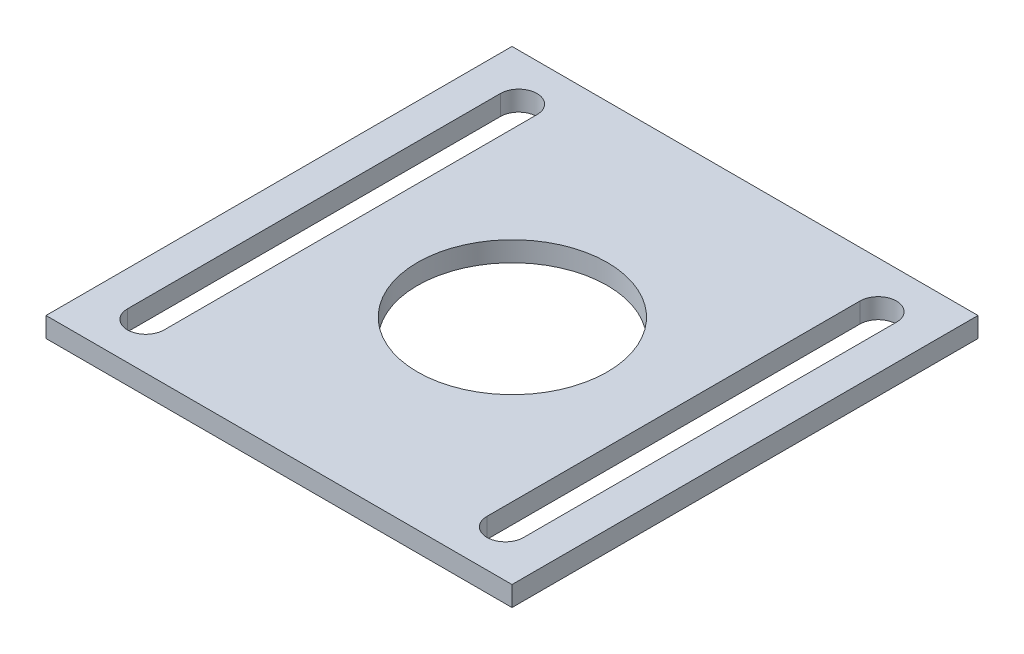
ISO-10303-21;
HEADER;
FILE_DESCRIPTION(('STEP AP214'),'2;1');
FILE_NAME('part.step','',(''),(''),'','','');
FILE_SCHEMA(('AUTOMOTIVE_DESIGN { 1 0 10303 214 1 1 1 1 }'));
ENDSEC;
DATA;
#1=APPLICATION_CONTEXT('core data for automotive mechanical design processes');
#2=APPLICATION_PROTOCOL_DEFINITION('international standard','automotive_design',2000,#1);
#3=PRODUCT_CONTEXT('',#1,'mechanical');
#4=PRODUCT('Part','Part','',(#3));
#5=PRODUCT_RELATED_PRODUCT_CATEGORY('part','',(#4));
#6=PRODUCT_DEFINITION_FORMATION('','',#4);
#7=PRODUCT_DEFINITION_CONTEXT('part definition',#1,'design');
#8=PRODUCT_DEFINITION('design','',#6,#7);
#9=PRODUCT_DEFINITION_SHAPE('','',#8);
#10=(LENGTH_UNIT() NAMED_UNIT(*) SI_UNIT(.MILLI.,.METRE.));
#11=(NAMED_UNIT(*) PLANE_ANGLE_UNIT() SI_UNIT($,.RADIAN.));
#12=(NAMED_UNIT(*) SI_UNIT($,.STERADIAN.) SOLID_ANGLE_UNIT());
#13=UNCERTAINTY_MEASURE_WITH_UNIT(LENGTH_MEASURE(1.E-05),#10,'distance_accuracy_value','');
#14=(GEOMETRIC_REPRESENTATION_CONTEXT(3) GLOBAL_UNCERTAINTY_ASSIGNED_CONTEXT((#13)) GLOBAL_UNIT_ASSIGNED_CONTEXT((#10,
#11,#12)) REPRESENTATION_CONTEXT('',''));
#15=CARTESIAN_POINT('',(0.,0.,0.));
#16=DIRECTION('',(0.,0.,1.));
#17=DIRECTION('',(1.,0.,0.));
#18=AXIS2_PLACEMENT_3D('',#15,#16,#17);
#19=CARTESIAN_POINT('',(0.,3.,0.));
#20=DIRECTION('',(-1.,0.,0.));
#21=DIRECTION('',(0.,0.,1.));
#22=AXIS2_PLACEMENT_3D('',#19,#20,#21);
#23=PLANE('',#22);
#24=DIRECTION('',(0.,0.,-1.));
#25=VECTOR('',#24,1.);
#26=CARTESIAN_POINT('',(0.,0.,0.));
#27=LINE('',#26,#25);
#28=CARTESIAN_POINT('',(0.,0.,0.));
#29=VERTEX_POINT('',#28);
#30=CARTESIAN_POINT('',(0.,0.,-70.));
#31=VERTEX_POINT('',#30);
#32=EDGE_CURVE('E260',#29,#31,#27,.T.);
#33=ORIENTED_EDGE('',*,*,#32,.F.);
#34=DIRECTION('',(0.,-1.,0.));
#35=VECTOR('',#34,1.);
#36=CARTESIAN_POINT('',(0.,3.,0.));
#37=LINE('',#36,#35);
#38=CARTESIAN_POINT('',(0.,3.,0.));
#39=VERTEX_POINT('',#38);
#40=EDGE_CURVE('E12',#39,#29,#37,.T.);
#41=ORIENTED_EDGE('',*,*,#40,.F.);
#42=DIRECTION('',(0.,0.,-1.));
#43=VECTOR('',#42,1.);
#44=CARTESIAN_POINT('',(0.,3.,0.));
#45=LINE('',#44,#43);
#46=CARTESIAN_POINT('',(0.,3.,-70.));
#47=VERTEX_POINT('',#46);
#48=EDGE_CURVE('E257',#39,#47,#45,.T.);
#49=ORIENTED_EDGE('',*,*,#48,.T.);
#50=DIRECTION('',(0.,-1.,0.));
#51=VECTOR('',#50,1.);
#52=CARTESIAN_POINT('',(0.,3.,-70.));
#53=LINE('',#52,#51);
#54=EDGE_CURVE('E51',#47,#31,#53,.T.);
#55=ORIENTED_EDGE('',*,*,#54,.T.);
#56=EDGE_LOOP('',(#33,#41,#49,#55));
#57=FACE_BOUND('',#56,.T.);
#58=ADVANCED_FACE('F48',(#57),#23,.T.);
#59=CARTESIAN_POINT('',(0.,3.,0.));
#60=DIRECTION('',(0.,0.,-1.));
#61=DIRECTION('',(-1.,0.,0.));
#62=AXIS2_PLACEMENT_3D('',#59,#60,#61);
#63=PLANE('',#62);
#64=DIRECTION('',(1.,0.,0.));
#65=VECTOR('',#64,1.);
#66=CARTESIAN_POINT('',(0.,0.,0.));
#67=LINE('',#66,#65);
#68=CARTESIAN_POINT('',(70.,0.,0.));
#69=VERTEX_POINT('',#68);
#70=EDGE_CURVE('E285',#29,#69,#67,.T.);
#71=ORIENTED_EDGE('',*,*,#70,.T.);
#72=DIRECTION('',(0.,-1.,0.));
#73=VECTOR('',#72,1.);
#74=CARTESIAN_POINT('',(70.,3.,0.));
#75=LINE('',#74,#73);
#76=CARTESIAN_POINT('',(70.,3.,0.));
#77=VERTEX_POINT('',#76);
#78=EDGE_CURVE('E60',#77,#69,#75,.T.);
#79=ORIENTED_EDGE('',*,*,#78,.F.);
#80=DIRECTION('',(1.,0.,0.));
#81=VECTOR('',#80,1.);
#82=CARTESIAN_POINT('',(0.,3.,0.));
#83=LINE('',#82,#81);
#84=EDGE_CURVE('E266',#39,#77,#83,.T.);
#85=ORIENTED_EDGE('',*,*,#84,.F.);
#86=ORIENTED_EDGE('',*,*,#40,.T.);
#87=EDGE_LOOP('',(#71,#79,#85,#86));
#88=FACE_BOUND('',#87,.T.);
#89=ADVANCED_FACE('F307',(#88),#63,.F.);
#90=CARTESIAN_POINT('',(70.,3.,0.));
#91=DIRECTION('',(-1.,0.,0.));
#92=DIRECTION('',(0.,0.,1.));
#93=AXIS2_PLACEMENT_3D('',#90,#91,#92);
#94=PLANE('',#93);
#95=DIRECTION('',(0.,0.,-1.));
#96=VECTOR('',#95,1.);
#97=CARTESIAN_POINT('',(70.,0.,0.));
#98=LINE('',#97,#96);
#99=CARTESIAN_POINT('',(70.,0.,-70.));
#100=VERTEX_POINT('',#99);
#101=EDGE_CURVE('E276',#69,#100,#98,.T.);
#102=ORIENTED_EDGE('',*,*,#101,.T.);
#103=DIRECTION('',(0.,-1.,0.));
#104=VECTOR('',#103,1.);
#105=CARTESIAN_POINT('',(70.,3.,-70.));
#106=LINE('',#105,#104);
#107=CARTESIAN_POINT('',(70.,3.,-70.));
#108=VERTEX_POINT('',#107);
#109=EDGE_CURVE('E288',#108,#100,#106,.T.);
#110=ORIENTED_EDGE('',*,*,#109,.F.);
#111=DIRECTION('',(0.,0.,-1.));
#112=VECTOR('',#111,1.);
#113=CARTESIAN_POINT('',(70.,3.,0.));
#114=LINE('',#113,#112);
#115=EDGE_CURVE('E269',#77,#108,#114,.T.);
#116=ORIENTED_EDGE('',*,*,#115,.F.);
#117=ORIENTED_EDGE('',*,*,#78,.T.);
#118=EDGE_LOOP('',(#102,#110,#116,#117));
#119=FACE_BOUND('',#118,.T.);
#120=ADVANCED_FACE('F313',(#119),#94,.F.);
#121=CARTESIAN_POINT('',(0.,3.,-70.));
#122=DIRECTION('',(0.,0.,-1.));
#123=DIRECTION('',(-1.,0.,0.));
#124=AXIS2_PLACEMENT_3D('',#121,#122,#123);
#125=PLANE('',#124);
#126=DIRECTION('',(1.,0.,0.));
#127=VECTOR('',#126,1.);
#128=CARTESIAN_POINT('',(0.,0.,-70.));
#129=LINE('',#128,#127);
#130=EDGE_CURVE('E274',#31,#100,#129,.T.);
#131=ORIENTED_EDGE('',*,*,#130,.F.);
#132=ORIENTED_EDGE('',*,*,#54,.F.);
#133=DIRECTION('',(1.,0.,0.));
#134=VECTOR('',#133,1.);
#135=CARTESIAN_POINT('',(0.,3.,-70.));
#136=LINE('',#135,#134);
#137=EDGE_CURVE('E314',#47,#108,#136,.T.);
#138=ORIENTED_EDGE('',*,*,#137,.T.);
#139=ORIENTED_EDGE('',*,*,#109,.T.);
#140=EDGE_LOOP('',(#131,#132,#138,#139));
#141=FACE_BOUND('',#140,.T.);
#142=ADVANCED_FACE('F297',(#141),#125,.T.);
#143=CARTESIAN_POINT('',(0.,3.,0.));
#144=DIRECTION('',(0.,-1.,0.));
#145=DIRECTION('',(0.,0.,-1.));
#146=AXIS2_PLACEMENT_3D('',#143,#144,#145);
#147=PLANE('',#146);
#148=DIRECTION('',(0.,0.,1.));
#149=VECTOR('',#148,1.);
#150=CARTESIAN_POINT('',(59.25,3.,-63.0084103239682));
#151=LINE('',#150,#149);
#152=CARTESIAN_POINT('',(59.25,3.,-63.0084103239682));
#153=VERTEX_POINT('',#152);
#154=CARTESIAN_POINT('',(59.25,3.,-6.99158967603184));
#155=VERTEX_POINT('',#154);
#156=EDGE_CURVE('E206',#153,#155,#151,.T.);
#157=ORIENTED_EDGE('',*,*,#156,.F.);
#158=CARTESIAN_POINT('',(62.,3.,-63.0084103239682));
#159=DIRECTION('',(0.,1.,0.));
#160=DIRECTION('',(0.,0.,1.));
#161=AXIS2_PLACEMENT_3D('',#158,#159,#160);
#162=CIRCLE('',#161,2.75);
#163=CARTESIAN_POINT('',(64.75,3.,-63.0084103239682));
#164=VERTEX_POINT('',#163);
#165=EDGE_CURVE('E62',#164,#153,#162,.T.);
#166=ORIENTED_EDGE('',*,*,#165,.F.);
#167=DIRECTION('',(0.,0.,-1.));
#168=VECTOR('',#167,1.);
#169=CARTESIAN_POINT('',(64.75,3.,-63.0084103239682));
#170=LINE('',#169,#168);
#171=CARTESIAN_POINT('',(64.75,3.,-6.99158967603183));
#172=VERTEX_POINT('',#171);
#173=EDGE_CURVE('E212',#172,#164,#170,.T.);
#174=ORIENTED_EDGE('',*,*,#173,.F.);
#175=CARTESIAN_POINT('',(62.,3.,-6.99158967603183));
#176=DIRECTION('',(0.,1.,0.));
#177=DIRECTION('',(0.,0.,1.));
#178=AXIS2_PLACEMENT_3D('',#175,#176,#177);
#179=CIRCLE('',#178,2.75);
#180=EDGE_CURVE('E209',#155,#172,#179,.T.);
#181=ORIENTED_EDGE('',*,*,#180,.F.);
#182=EDGE_LOOP('',(#157,#166,#174,#181));
#183=FACE_BOUND('',#182,.T.);
#184=DIRECTION('',(0.,0.,1.));
#185=VECTOR('',#184,1.);
#186=CARTESIAN_POINT('',(5.25,3.,-63.0084103239682));
#187=LINE('',#186,#185);
#188=CARTESIAN_POINT('',(5.25,3.,-63.0084103239682));
#189=VERTEX_POINT('',#188);
#190=CARTESIAN_POINT('',(5.25,3.,-6.99158967603184));
#191=VERTEX_POINT('',#190);
#192=EDGE_CURVE('E159',#189,#191,#187,.T.);
#193=ORIENTED_EDGE('',*,*,#192,.F.);
#194=CARTESIAN_POINT('',(8.,3.,-63.0084103239682));
#195=DIRECTION('',(0.,1.,0.));
#196=DIRECTION('',(0.,0.,1.));
#197=AXIS2_PLACEMENT_3D('',#194,#195,#196);
#198=CIRCLE('',#197,2.75);
#199=CARTESIAN_POINT('',(10.75,3.,-63.0084103239682));
#200=VERTEX_POINT('',#199);
#201=EDGE_CURVE('E71',#200,#189,#198,.T.);
#202=ORIENTED_EDGE('',*,*,#201,.F.);
#203=DIRECTION('',(0.,0.,-1.));
#204=VECTOR('',#203,1.);
#205=CARTESIAN_POINT('',(10.75,3.,-63.0084103239682));
#206=LINE('',#205,#204);
#207=CARTESIAN_POINT('',(10.75,3.,-6.99158967603183));
#208=VERTEX_POINT('',#207);
#209=EDGE_CURVE('E146',#208,#200,#206,.T.);
#210=ORIENTED_EDGE('',*,*,#209,.F.);
#211=CARTESIAN_POINT('',(8.,3.,-6.99158967603183));
#212=DIRECTION('',(0.,1.,0.));
#213=DIRECTION('',(0.,0.,1.));
#214=AXIS2_PLACEMENT_3D('',#211,#212,#213);
#215=CIRCLE('',#214,2.75);
#216=EDGE_CURVE('E152',#191,#208,#215,.T.);
#217=ORIENTED_EDGE('',*,*,#216,.F.);
#218=EDGE_LOOP('',(#193,#202,#210,#217));
#219=FACE_BOUND('',#218,.T.);
#220=CARTESIAN_POINT('',(35.2514133048523,3.,-34.8026013268432));
#221=DIRECTION('',(0.,1.,0.));
#222=DIRECTION('',(0.,0.,1.));
#223=AXIS2_PLACEMENT_3D('',#220,#221,#222);
#224=CIRCLE('',#223,14.255);
#225=CARTESIAN_POINT('',(35.2514133048523,3.,-20.5476013268432));
#226=VERTEX_POINT('',#225);
#227=EDGE_CURVE('E165',#226,#226,#224,.T.);
#228=ORIENTED_EDGE('',*,*,#227,.F.);
#229=EDGE_LOOP('',(#228));
#230=FACE_BOUND('',#229,.T.);
#231=ORIENTED_EDGE('',*,*,#48,.F.);
#232=ORIENTED_EDGE('',*,*,#84,.T.);
#233=ORIENTED_EDGE('',*,*,#115,.T.);
#234=ORIENTED_EDGE('',*,*,#137,.F.);
#235=EDGE_LOOP('',(#231,#232,#233,#234));
#236=FACE_BOUND('',#235,.T.);
#237=ADVANCED_FACE('F160',(#183,#219,#230,#236),#147,.F.);
#238=CARTESIAN_POINT('',(0.,0.,0.));
#239=DIRECTION('',(0.,-1.,0.));
#240=DIRECTION('',(0.,0.,-1.));
#241=AXIS2_PLACEMENT_3D('',#238,#239,#240);
#242=PLANE('',#241);
#243=CARTESIAN_POINT('',(62.,0.,-63.0084103239682));
#244=DIRECTION('',(0.,1.,0.));
#245=DIRECTION('',(0.,0.,1.));
#246=AXIS2_PLACEMENT_3D('',#243,#244,#245);
#247=CIRCLE('',#246,2.75);
#248=CARTESIAN_POINT('',(64.75,0.,-63.0084103239682));
#249=VERTEX_POINT('',#248);
#250=CARTESIAN_POINT('',(59.25,0.,-63.0084103239682));
#251=VERTEX_POINT('',#250);
#252=EDGE_CURVE('E217',#249,#251,#247,.T.);
#253=ORIENTED_EDGE('',*,*,#252,.T.);
#254=DIRECTION('',(0.,0.,1.));
#255=VECTOR('',#254,1.);
#256=CARTESIAN_POINT('',(59.25,0.,-63.0084103239682));
#257=LINE('',#256,#255);
#258=CARTESIAN_POINT('',(59.25,0.,-6.99158967603184));
#259=VERTEX_POINT('',#258);
#260=EDGE_CURVE('E225',#251,#259,#257,.T.);
#261=ORIENTED_EDGE('',*,*,#260,.T.);
#262=CARTESIAN_POINT('',(62.,0.,-6.99158967603183));
#263=DIRECTION('',(0.,1.,0.));
#264=DIRECTION('',(0.,0.,1.));
#265=AXIS2_PLACEMENT_3D('',#262,#263,#264);
#266=CIRCLE('',#265,2.75);
#267=CARTESIAN_POINT('',(64.75,0.,-6.99158967603183));
#268=VERTEX_POINT('',#267);
#269=EDGE_CURVE('E229',#259,#268,#266,.T.);
#270=ORIENTED_EDGE('',*,*,#269,.T.);
#271=DIRECTION('',(0.,0.,-1.));
#272=VECTOR('',#271,1.);
#273=CARTESIAN_POINT('',(64.75,0.,-63.0084103239682));
#274=LINE('',#273,#272);
#275=EDGE_CURVE('E227',#268,#249,#274,.T.);
#276=ORIENTED_EDGE('',*,*,#275,.T.);
#277=EDGE_LOOP('',(#253,#261,#270,#276));
#278=FACE_BOUND('',#277,.T.);
#279=CARTESIAN_POINT('',(8.,0.,-63.0084103239682));
#280=DIRECTION('',(0.,1.,0.));
#281=DIRECTION('',(0.,0.,1.));
#282=AXIS2_PLACEMENT_3D('',#279,#280,#281);
#283=CIRCLE('',#282,2.75);
#284=CARTESIAN_POINT('',(10.75,0.,-63.0084103239682));
#285=VERTEX_POINT('',#284);
#286=CARTESIAN_POINT('',(5.25,0.,-63.0084103239682));
#287=VERTEX_POINT('',#286);
#288=EDGE_CURVE('E139',#285,#287,#283,.T.);
#289=ORIENTED_EDGE('',*,*,#288,.T.);
#290=DIRECTION('',(0.,0.,1.));
#291=VECTOR('',#290,1.);
#292=CARTESIAN_POINT('',(5.25,0.,-63.0084103239682));
#293=LINE('',#292,#291);
#294=CARTESIAN_POINT('',(5.25,0.,-6.99158967603184));
#295=VERTEX_POINT('',#294);
#296=EDGE_CURVE('E200',#287,#295,#293,.T.);
#297=ORIENTED_EDGE('',*,*,#296,.T.);
#298=CARTESIAN_POINT('',(8.,0.,-6.99158967603183));
#299=DIRECTION('',(0.,1.,0.));
#300=DIRECTION('',(0.,0.,1.));
#301=AXIS2_PLACEMENT_3D('',#298,#299,#300);
#302=CIRCLE('',#301,2.75);
#303=CARTESIAN_POINT('',(10.75,0.,-6.99158967603183));
#304=VERTEX_POINT('',#303);
#305=EDGE_CURVE('E191',#295,#304,#302,.T.);
#306=ORIENTED_EDGE('',*,*,#305,.T.);
#307=DIRECTION('',(0.,0.,-1.));
#308=VECTOR('',#307,1.);
#309=CARTESIAN_POINT('',(10.75,0.,-63.0084103239682));
#310=LINE('',#309,#308);
#311=EDGE_CURVE('E173',#304,#285,#310,.T.);
#312=ORIENTED_EDGE('',*,*,#311,.T.);
#313=EDGE_LOOP('',(#289,#297,#306,#312));
#314=FACE_BOUND('',#313,.T.);
#315=CARTESIAN_POINT('',(35.2514133048523,0.,-34.8026013268432));
#316=DIRECTION('',(0.,1.,0.));
#317=DIRECTION('',(0.,0.,1.));
#318=AXIS2_PLACEMENT_3D('',#315,#316,#317);
#319=CIRCLE('',#318,14.255);
#320=CARTESIAN_POINT('',(35.2514133048523,0.,-20.5476013268432));
#321=VERTEX_POINT('',#320);
#322=EDGE_CURVE('E170',#321,#321,#319,.T.);
#323=ORIENTED_EDGE('',*,*,#322,.T.);
#324=EDGE_LOOP('',(#323));
#325=FACE_BOUND('',#324,.T.);
#326=ORIENTED_EDGE('',*,*,#32,.T.);
#327=ORIENTED_EDGE('',*,*,#130,.T.);
#328=ORIENTED_EDGE('',*,*,#101,.F.);
#329=ORIENTED_EDGE('',*,*,#70,.F.);
#330=EDGE_LOOP('',(#326,#327,#328,#329));
#331=FACE_BOUND('',#330,.T.);
#332=ADVANCED_FACE('F302',(#278,#314,#325,#331),#242,.T.);
#333=CARTESIAN_POINT('',(35.2514133048523,0.,-34.8026013268432));
#334=DIRECTION('',(0.,1.,0.));
#335=DIRECTION('',(0.,0.,1.));
#336=AXIS2_PLACEMENT_3D('',#333,#334,#335);
#337=CYLINDRICAL_SURFACE('',#336,14.255);
#338=ORIENTED_EDGE('',*,*,#322,.F.);
#339=EDGE_LOOP('',(#338));
#340=FACE_BOUND('',#339,.T.);
#341=ORIENTED_EDGE('',*,*,#227,.T.);
#342=EDGE_LOOP('',(#341));
#343=FACE_BOUND('',#342,.T.);
#344=ADVANCED_FACE('F324',(#340,#343),#337,.F.);
#345=CARTESIAN_POINT('',(8.,0.,-63.0084103239682));
#346=DIRECTION('',(0.,1.,0.));
#347=DIRECTION('',(0.,0.,1.));
#348=AXIS2_PLACEMENT_3D('',#345,#346,#347);
#349=CYLINDRICAL_SURFACE('',#348,2.75);
#350=ORIENTED_EDGE('',*,*,#201,.T.);
#351=DIRECTION('',(0.,1.,0.));
#352=VECTOR('',#351,1.);
#353=CARTESIAN_POINT('',(5.25,0.,-63.0084103239682));
#354=LINE('',#353,#352);
#355=EDGE_CURVE('E198',#287,#189,#354,.T.);
#356=ORIENTED_EDGE('',*,*,#355,.F.);
#357=ORIENTED_EDGE('',*,*,#288,.F.);
#358=DIRECTION('',(0.,1.,0.));
#359=VECTOR('',#358,1.);
#360=CARTESIAN_POINT('',(10.75,0.,-63.0084103239682));
#361=LINE('',#360,#359);
#362=EDGE_CURVE('E136',#285,#200,#361,.T.);
#363=ORIENTED_EDGE('',*,*,#362,.T.);
#364=EDGE_LOOP('',(#350,#356,#357,#363));
#365=FACE_BOUND('',#364,.T.);
#366=ADVANCED_FACE('F138',(#365),#349,.F.);
#367=CARTESIAN_POINT('',(10.75,0.,-63.0084103239682));
#368=DIRECTION('',(1.,0.,0.));
#369=DIRECTION('',(0.,0.,-1.));
#370=AXIS2_PLACEMENT_3D('',#367,#368,#369);
#371=PLANE('',#370);
#372=ORIENTED_EDGE('',*,*,#209,.T.);
#373=ORIENTED_EDGE('',*,*,#362,.F.);
#374=ORIENTED_EDGE('',*,*,#311,.F.);
#375=DIRECTION('',(0.,1.,0.));
#376=VECTOR('',#375,1.);
#377=CARTESIAN_POINT('',(10.75,0.,-6.99158967603183));
#378=LINE('',#377,#376);
#379=EDGE_CURVE('E144',#304,#208,#378,.T.);
#380=ORIENTED_EDGE('',*,*,#379,.T.);
#381=EDGE_LOOP('',(#372,#373,#374,#380));
#382=FACE_BOUND('',#381,.T.);
#383=ADVANCED_FACE('F149',(#382),#371,.F.);
#384=CARTESIAN_POINT('',(8.,0.,-6.99158967603183));
#385=DIRECTION('',(0.,1.,0.));
#386=DIRECTION('',(0.,0.,1.));
#387=AXIS2_PLACEMENT_3D('',#384,#385,#386);
#388=CYLINDRICAL_SURFACE('',#387,2.75);
#389=ORIENTED_EDGE('',*,*,#216,.T.);
#390=ORIENTED_EDGE('',*,*,#379,.F.);
#391=ORIENTED_EDGE('',*,*,#305,.F.);
#392=DIRECTION('',(0.,1.,0.));
#393=VECTOR('',#392,1.);
#394=CARTESIAN_POINT('',(5.25,0.,-6.99158967603184));
#395=LINE('',#394,#393);
#396=EDGE_CURVE('E188',#295,#191,#395,.T.);
#397=ORIENTED_EDGE('',*,*,#396,.T.);
#398=EDGE_LOOP('',(#389,#390,#391,#397));
#399=FACE_BOUND('',#398,.T.);
#400=ADVANCED_FACE('F186',(#399),#388,.F.);
#401=CARTESIAN_POINT('',(5.25,0.,-63.0084103239682));
#402=DIRECTION('',(-1.,0.,0.));
#403=DIRECTION('',(0.,0.,1.));
#404=AXIS2_PLACEMENT_3D('',#401,#402,#403);
#405=PLANE('',#404);
#406=ORIENTED_EDGE('',*,*,#192,.T.);
#407=ORIENTED_EDGE('',*,*,#396,.F.);
#408=ORIENTED_EDGE('',*,*,#296,.F.);
#409=ORIENTED_EDGE('',*,*,#355,.T.);
#410=EDGE_LOOP('',(#406,#407,#408,#409));
#411=FACE_BOUND('',#410,.T.);
#412=ADVANCED_FACE('F196',(#411),#405,.F.);
#413=CARTESIAN_POINT('',(62.,0.,-63.0084103239682));
#414=DIRECTION('',(0.,1.,0.));
#415=DIRECTION('',(0.,0.,1.));
#416=AXIS2_PLACEMENT_3D('',#413,#414,#415);
#417=CYLINDRICAL_SURFACE('',#416,2.75);
#418=ORIENTED_EDGE('',*,*,#165,.T.);
#419=DIRECTION('',(0.,1.,0.));
#420=VECTOR('',#419,1.);
#421=CARTESIAN_POINT('',(59.25,0.,-63.0084103239682));
#422=LINE('',#421,#420);
#423=EDGE_CURVE('E232',#251,#153,#422,.T.);
#424=ORIENTED_EDGE('',*,*,#423,.F.);
#425=ORIENTED_EDGE('',*,*,#252,.F.);
#426=DIRECTION('',(0.,1.,0.));
#427=VECTOR('',#426,1.);
#428=CARTESIAN_POINT('',(64.75,0.,-63.0084103239682));
#429=LINE('',#428,#427);
#430=EDGE_CURVE('E245',#249,#164,#429,.T.);
#431=ORIENTED_EDGE('',*,*,#430,.T.);
#432=EDGE_LOOP('',(#418,#424,#425,#431));
#433=FACE_BOUND('',#432,.T.);
#434=ADVANCED_FACE('F398',(#433),#417,.F.);
#435=CARTESIAN_POINT('',(64.75,0.,-63.0084103239682));
#436=DIRECTION('',(1.,0.,0.));
#437=DIRECTION('',(0.,0.,-1.));
#438=AXIS2_PLACEMENT_3D('',#435,#436,#437);
#439=PLANE('',#438);
#440=ORIENTED_EDGE('',*,*,#173,.T.);
#441=ORIENTED_EDGE('',*,*,#430,.F.);
#442=ORIENTED_EDGE('',*,*,#275,.F.);
#443=DIRECTION('',(0.,1.,0.));
#444=VECTOR('',#443,1.);
#445=CARTESIAN_POINT('',(64.75,0.,-6.99158967603183));
#446=LINE('',#445,#444);
#447=EDGE_CURVE('E238',#268,#172,#446,.T.);
#448=ORIENTED_EDGE('',*,*,#447,.T.);
#449=EDGE_LOOP('',(#440,#441,#442,#448));
#450=FACE_BOUND('',#449,.T.);
#451=ADVANCED_FACE('F406',(#450),#439,.F.);
#452=CARTESIAN_POINT('',(62.,0.,-6.99158967603183));
#453=DIRECTION('',(0.,1.,0.));
#454=DIRECTION('',(0.,0.,1.));
#455=AXIS2_PLACEMENT_3D('',#452,#453,#454);
#456=CYLINDRICAL_SURFACE('',#455,2.75);
#457=ORIENTED_EDGE('',*,*,#180,.T.);
#458=ORIENTED_EDGE('',*,*,#447,.F.);
#459=ORIENTED_EDGE('',*,*,#269,.F.);
#460=DIRECTION('',(0.,1.,0.));
#461=VECTOR('',#460,1.);
#462=CARTESIAN_POINT('',(59.25,0.,-6.99158967603184));
#463=LINE('',#462,#461);
#464=EDGE_CURVE('E240',#259,#155,#463,.T.);
#465=ORIENTED_EDGE('',*,*,#464,.T.);
#466=EDGE_LOOP('',(#457,#458,#459,#465));
#467=FACE_BOUND('',#466,.T.);
#468=ADVANCED_FACE('F418',(#467),#456,.F.);
#469=CARTESIAN_POINT('',(59.25,0.,-63.0084103239682));
#470=DIRECTION('',(-1.,0.,0.));
#471=DIRECTION('',(0.,0.,1.));
#472=AXIS2_PLACEMENT_3D('',#469,#470,#471);
#473=PLANE('',#472);
#474=ORIENTED_EDGE('',*,*,#156,.T.);
#475=ORIENTED_EDGE('',*,*,#464,.F.);
#476=ORIENTED_EDGE('',*,*,#260,.F.);
#477=ORIENTED_EDGE('',*,*,#423,.T.);
#478=EDGE_LOOP('',(#474,#475,#476,#477));
#479=FACE_BOUND('',#478,.T.);
#480=ADVANCED_FACE('F426',(#479),#473,.F.);
#481=CLOSED_SHELL('',(#58,#89,#120,#142,#237,#332,#344,#366,#383,#400,#412,#434,#451,#468,#480));
#482=MANIFOLD_SOLID_BREP('B2',#481);
#483=ADVANCED_BREP_SHAPE_REPRESENTATION('',(#18,#482),#14);
#484=SHAPE_DEFINITION_REPRESENTATION(#9,#483);
ENDSEC;
END-ISO-10303-21;
